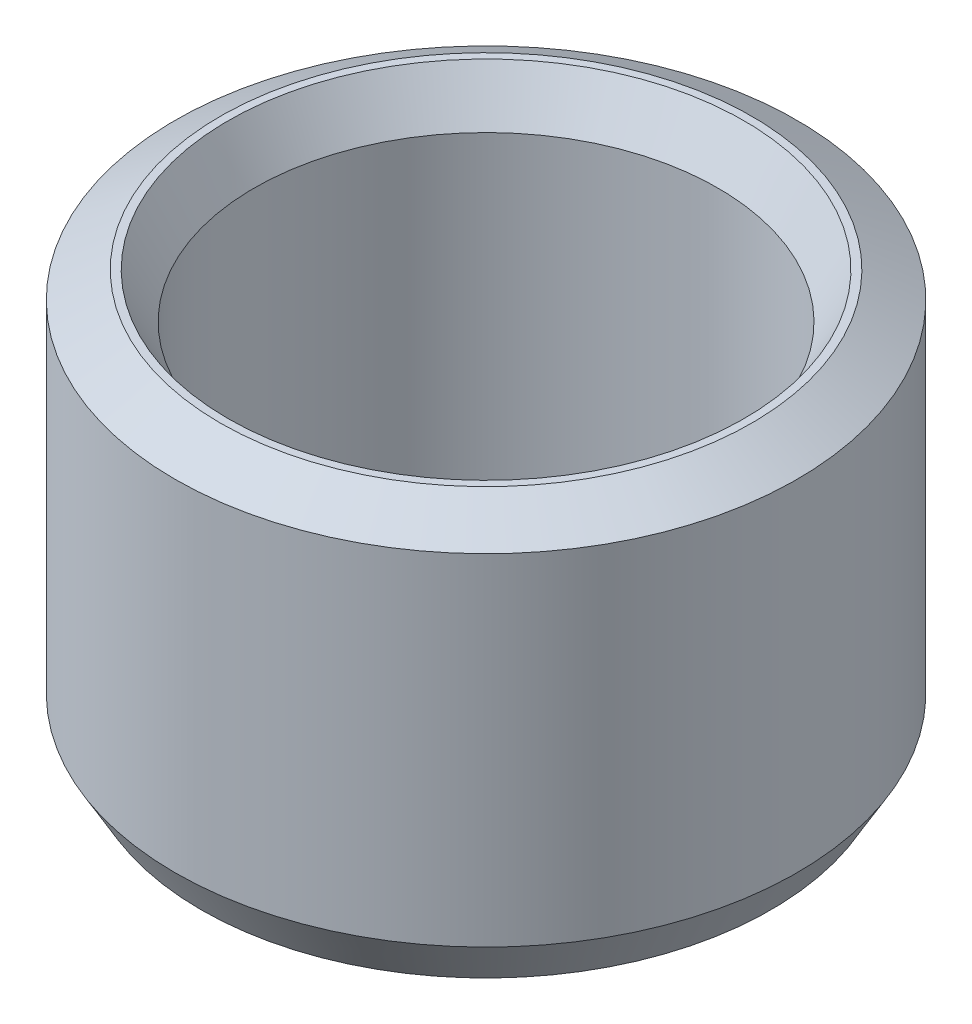
ISO-10303-21;
HEADER;
FILE_DESCRIPTION(('STEP AP214'),'2;1');
FILE_NAME('part.step','',(''),(''),'','','');
FILE_SCHEMA(('AUTOMOTIVE_DESIGN { 1 0 10303 214 1 1 1 1 }'));
ENDSEC;
DATA;
#1=APPLICATION_CONTEXT('core data for automotive mechanical design processes');
#2=APPLICATION_PROTOCOL_DEFINITION('international standard','automotive_design',2000,#1);
#3=PRODUCT_CONTEXT('',#1,'mechanical');
#4=PRODUCT('Part','Part','',(#3));
#5=PRODUCT_RELATED_PRODUCT_CATEGORY('part','',(#4));
#6=PRODUCT_DEFINITION_FORMATION('','',#4);
#7=PRODUCT_DEFINITION_CONTEXT('part definition',#1,'design');
#8=PRODUCT_DEFINITION('design','',#6,#7);
#9=PRODUCT_DEFINITION_SHAPE('','',#8);
#10=(LENGTH_UNIT() NAMED_UNIT(*) SI_UNIT(.MILLI.,.METRE.));
#11=(NAMED_UNIT(*) PLANE_ANGLE_UNIT() SI_UNIT($,.RADIAN.));
#12=(NAMED_UNIT(*) SI_UNIT($,.STERADIAN.) SOLID_ANGLE_UNIT());
#13=UNCERTAINTY_MEASURE_WITH_UNIT(LENGTH_MEASURE(1.E-05),#10,'distance_accuracy_value','');
#14=(GEOMETRIC_REPRESENTATION_CONTEXT(3) GLOBAL_UNCERTAINTY_ASSIGNED_CONTEXT((#13)) GLOBAL_UNIT_ASSIGNED_CONTEXT((#10,
#11,#12)) REPRESENTATION_CONTEXT('',''));
#15=CARTESIAN_POINT('',(0.,0.,0.));
#16=DIRECTION('',(0.,0.,1.));
#17=DIRECTION('',(1.,0.,0.));
#18=AXIS2_PLACEMENT_3D('',#15,#16,#17);
#19=CARTESIAN_POINT('',(0.,39.7491233903214,0.));
#20=DIRECTION('',(0.,-1.,0.));
#21=DIRECTION('',(0.,0.,-1.));
#22=AXIS2_PLACEMENT_3D('',#19,#20,#21);
#23=CYLINDRICAL_SURFACE('',#22,30.);
#24=CARTESIAN_POINT('',(0.,4.36193077633634,0.));
#25=DIRECTION('',(0.,1.,0.));
#26=DIRECTION('',(0.,0.,1.));
#27=AXIS2_PLACEMENT_3D('',#24,#25,#26);
#28=CIRCLE('',#27,30.);
#29=CARTESIAN_POINT('',(0.,4.36193077633634,30.));
#30=VERTEX_POINT('',#29);
#31=EDGE_CURVE('E10',#30,#30,#28,.T.);
#32=ORIENTED_EDGE('',*,*,#31,.T.);
#33=EDGE_LOOP('',(#32));
#34=FACE_BOUND('',#33,.T.);
#35=CARTESIAN_POINT('',(0.,37.2307614824171,0.));
#36=DIRECTION('',(0.,1.,0.));
#37=DIRECTION('',(0.,0.,1.));
#38=AXIS2_PLACEMENT_3D('',#35,#36,#37);
#39=CIRCLE('',#38,30.);
#40=CARTESIAN_POINT('',(0.,37.2307614824171,30.));
#41=VERTEX_POINT('',#40);
#42=EDGE_CURVE('E50',#41,#41,#39,.F.);
#43=ORIENTED_EDGE('',*,*,#42,.T.);
#44=EDGE_LOOP('',(#43));
#45=FACE_BOUND('',#44,.T.);
#46=ADVANCED_FACE('F39',(#34,#45),#23,.T.);
#47=CARTESIAN_POINT('',(0.,39.7491233903214,0.));
#48=DIRECTION('',(0.,1.,0.));
#49=DIRECTION('',(0.,0.,1.));
#50=AXIS2_PLACEMENT_3D('',#47,#48,#49);
#51=PLANE('',#50);
#52=CARTESIAN_POINT('',(0.,39.7491233903214,0.));
#53=DIRECTION('',(0.,1.,0.));
#54=DIRECTION('',(0.,0.,1.));
#55=AXIS2_PLACEMENT_3D('',#52,#53,#54);
#56=CIRCLE('',#55,24.8909797902166);
#57=CARTESIAN_POINT('',(0.,39.7491233903214,24.8909797902166));
#58=VERTEX_POINT('',#57);
#59=EDGE_CURVE('E58',#58,#58,#56,.F.);
#60=ORIENTED_EDGE('',*,*,#59,.T.);
#61=EDGE_LOOP('',(#60));
#62=FACE_BOUND('',#61,.T.);
#63=CARTESIAN_POINT('',(0.,39.7491233903214,0.));
#64=DIRECTION('',(0.,1.,0.));
#65=DIRECTION('',(0.,0.,1.));
#66=AXIS2_PLACEMENT_3D('',#63,#64,#65);
#67=CIRCLE('',#66,25.6380692236637);
#68=CARTESIAN_POINT('',(0.,39.7491233903214,25.6380692236637));
#69=VERTEX_POINT('',#68);
#70=EDGE_CURVE('E61',#69,#69,#67,.T.);
#71=ORIENTED_EDGE('',*,*,#70,.T.);
#72=EDGE_LOOP('',(#71));
#73=FACE_BOUND('',#72,.T.);
#74=ADVANCED_FACE('F88',(#62,#73),#51,.T.);
#75=CARTESIAN_POINT('',(0.,0.,0.));
#76=DIRECTION('',(0.,1.,0.));
#77=DIRECTION('',(0.,0.,1.));
#78=AXIS2_PLACEMENT_3D('',#75,#76,#77);
#79=PLANE('',#78);
#80=CARTESIAN_POINT('',(0.,0.,0.));
#81=DIRECTION('',(0.,1.,0.));
#82=DIRECTION('',(0.,0.,1.));
#83=AXIS2_PLACEMENT_3D('',#80,#81,#82);
#84=CIRCLE('',#83,26.7345486586487);
#85=CARTESIAN_POINT('',(0.,0.,26.7345486586487));
#86=VERTEX_POINT('',#85);
#87=EDGE_CURVE('E51',#86,#86,#84,.T.);
#88=ORIENTED_EDGE('',*,*,#87,.T.);
#89=EDGE_LOOP('',(#88));
#90=FACE_BOUND('',#89,.T.);
#91=CARTESIAN_POINT('',(0.,0.,0.));
#92=DIRECTION('',(0.,1.,0.));
#93=DIRECTION('',(0.,0.,1.));
#94=AXIS2_PLACEMENT_3D('',#91,#92,#93);
#95=CIRCLE('',#94,27.4816380920957);
#96=CARTESIAN_POINT('',(0.,0.,27.4816380920957));
#97=VERTEX_POINT('',#96);
#98=EDGE_CURVE('E54',#97,#97,#95,.F.);
#99=ORIENTED_EDGE('',*,*,#98,.T.);
#100=EDGE_LOOP('',(#99));
#101=FACE_BOUND('',#100,.T.);
#102=ADVANCED_FACE('F83',(#90,#101),#79,.F.);
#103=CARTESIAN_POINT('',(0.,39.7491233903214,0.));
#104=DIRECTION('',(0.,-1.,0.));
#105=DIRECTION('',(0.,0.,-1.));
#106=AXIS2_PLACEMENT_3D('',#103,#104,#105);
#107=CYLINDRICAL_SURFACE('',#106,22.3726178823123);
#108=CARTESIAN_POINT('',(0.,35.3871926139851,0.));
#109=DIRECTION('',(0.,1.,0.));
#110=DIRECTION('',(0.,0.,1.));
#111=AXIS2_PLACEMENT_3D('',#108,#109,#110);
#112=CIRCLE('',#111,22.3726178823123);
#113=CARTESIAN_POINT('',(0.,35.3871926139851,22.3726178823123));
#114=VERTEX_POINT('',#113);
#115=EDGE_CURVE('E67',#114,#114,#112,.T.);
#116=ORIENTED_EDGE('',*,*,#115,.T.);
#117=EDGE_LOOP('',(#116));
#118=FACE_BOUND('',#117,.T.);
#119=CARTESIAN_POINT('',(0.,2.51836190790432,0.));
#120=DIRECTION('',(0.,1.,0.));
#121=DIRECTION('',(0.,0.,1.));
#122=AXIS2_PLACEMENT_3D('',#119,#120,#121);
#123=CIRCLE('',#122,22.3726178823123);
#124=CARTESIAN_POINT('',(0.,2.51836190790432,22.3726178823123));
#125=VERTEX_POINT('',#124);
#126=EDGE_CURVE('E69',#125,#125,#123,.F.);
#127=ORIENTED_EDGE('',*,*,#126,.T.);
#128=EDGE_LOOP('',(#127));
#129=FACE_BOUND('',#128,.T.);
#130=ADVANCED_FACE('F71',(#118,#129),#107,.F.);
#131=CARTESIAN_POINT('',(0.,35.3871926139851,0.));
#132=DIRECTION('',(0.,1.,0.));
#133=DIRECTION('',(0.,0.,1.));
#134=AXIS2_PLACEMENT_3D('',#131,#132,#133);
#135=CONICAL_SURFACE('',#134,22.3726178823123,0.523598775598301);
#136=ORIENTED_EDGE('',*,*,#59,.F.);
#137=EDGE_LOOP('',(#136));
#138=FACE_BOUND('',#137,.T.);
#139=ORIENTED_EDGE('',*,*,#115,.F.);
#140=EDGE_LOOP('',(#139));
#141=FACE_BOUND('',#140,.T.);
#142=ADVANCED_FACE('F77',(#138,#141),#135,.F.);
#143=CARTESIAN_POINT('',(0.,0.,0.));
#144=DIRECTION('',(0.,-1.,0.));
#145=DIRECTION('',(0.,0.,-1.));
#146=AXIS2_PLACEMENT_3D('',#143,#144,#145);
#147=CONICAL_SURFACE('',#146,26.7345486586487,1.04719755119659);
#148=ORIENTED_EDGE('',*,*,#126,.F.);
#149=EDGE_LOOP('',(#148));
#150=FACE_BOUND('',#149,.T.);
#151=ORIENTED_EDGE('',*,*,#87,.F.);
#152=EDGE_LOOP('',(#151));
#153=FACE_BOUND('',#152,.T.);
#154=ADVANCED_FACE('F73',(#150,#153),#147,.F.);
#155=CARTESIAN_POINT('',(0.,4.36193077633634,0.));
#156=DIRECTION('',(0.,1.,0.));
#157=DIRECTION('',(0.,0.,1.));
#158=AXIS2_PLACEMENT_3D('',#155,#156,#157);
#159=CONICAL_SURFACE('',#158,30.,0.523598775598303);
#160=ORIENTED_EDGE('',*,*,#98,.F.);
#161=EDGE_LOOP('',(#160));
#162=FACE_BOUND('',#161,.T.);
#163=ORIENTED_EDGE('',*,*,#31,.F.);
#164=EDGE_LOOP('',(#163));
#165=FACE_BOUND('',#164,.T.);
#166=ADVANCED_FACE('F76',(#162,#165),#159,.T.);
#167=CARTESIAN_POINT('',(0.,39.7491233903214,0.));
#168=DIRECTION('',(0.,-1.,0.));
#169=DIRECTION('',(0.,0.,-1.));
#170=AXIS2_PLACEMENT_3D('',#167,#168,#169);
#171=CONICAL_SURFACE('',#170,25.6380692236637,1.04719755119659);
#172=ORIENTED_EDGE('',*,*,#42,.F.);
#173=EDGE_LOOP('',(#172));
#174=FACE_BOUND('',#173,.T.);
#175=ORIENTED_EDGE('',*,*,#70,.F.);
#176=EDGE_LOOP('',(#175));
#177=FACE_BOUND('',#176,.T.);
#178=ADVANCED_FACE('F45',(#174,#177),#171,.T.);
#179=CLOSED_SHELL('',(#46,#74,#102,#130,#142,#154,#166,#178));
#180=MANIFOLD_SOLID_BREP('B2',#179);
#181=ADVANCED_BREP_SHAPE_REPRESENTATION('',(#18,#180),#14);
#182=SHAPE_DEFINITION_REPRESENTATION(#9,#181);
ENDSEC;
END-ISO-10303-21;
